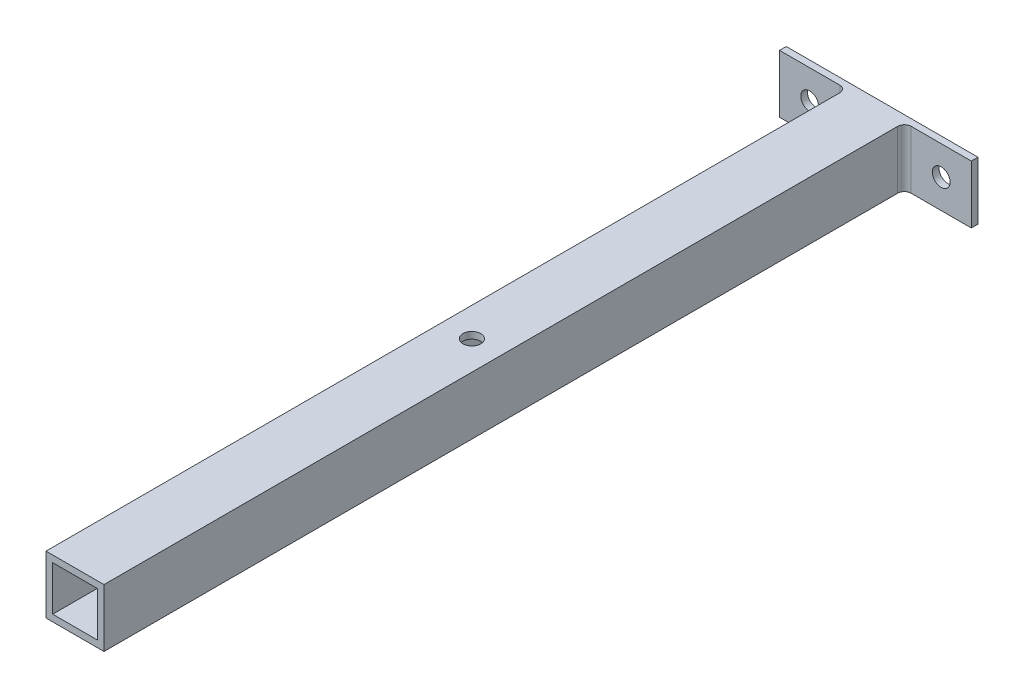
ISO-10303-21;
HEADER;
FILE_DESCRIPTION(('STEP AP214'),'2;1');
FILE_NAME('part.step','',(''),(''),'','','');
FILE_SCHEMA(('AUTOMOTIVE_DESIGN { 1 0 10303 214 1 1 1 1 }'));
ENDSEC;
DATA;
#1=APPLICATION_CONTEXT('core data for automotive mechanical design processes');
#2=APPLICATION_PROTOCOL_DEFINITION('international standard','automotive_design',2000,#1);
#3=PRODUCT_CONTEXT('',#1,'mechanical');
#4=PRODUCT('Part','Part','',(#3));
#5=PRODUCT_RELATED_PRODUCT_CATEGORY('part','',(#4));
#6=PRODUCT_DEFINITION_FORMATION('','',#4);
#7=PRODUCT_DEFINITION_CONTEXT('part definition',#1,'design');
#8=PRODUCT_DEFINITION('design','',#6,#7);
#9=PRODUCT_DEFINITION_SHAPE('','',#8);
#10=(LENGTH_UNIT() NAMED_UNIT(*) SI_UNIT(.MILLI.,.METRE.));
#11=(NAMED_UNIT(*) PLANE_ANGLE_UNIT() SI_UNIT($,.RADIAN.));
#12=(NAMED_UNIT(*) SI_UNIT($,.STERADIAN.) SOLID_ANGLE_UNIT());
#13=UNCERTAINTY_MEASURE_WITH_UNIT(LENGTH_MEASURE(1.E-05),#10,'distance_accuracy_value','');
#14=(GEOMETRIC_REPRESENTATION_CONTEXT(3) GLOBAL_UNCERTAINTY_ASSIGNED_CONTEXT((#13)) GLOBAL_UNIT_ASSIGNED_CONTEXT((#10,
#11,#12)) REPRESENTATION_CONTEXT('',''));
#15=CARTESIAN_POINT('',(0.,0.,0.));
#16=DIRECTION('',(0.,0.,1.));
#17=DIRECTION('',(1.,0.,0.));
#18=AXIS2_PLACEMENT_3D('',#15,#16,#17);
#19=CARTESIAN_POINT('',(-13.,26.,-181.));
#20=DIRECTION('',(0.,0.,1.));
#21=DIRECTION('',(1.,0.,0.));
#22=AXIS2_PLACEMENT_3D('',#19,#20,#21);
#23=PLANE('',#22);
#24=CARTESIAN_POINT('',(29.5,13.,-181.));
#25=DIRECTION('',(0.,0.,1.));
#26=DIRECTION('',(1.,0.,0.));
#27=AXIS2_PLACEMENT_3D('',#24,#25,#26);
#28=CIRCLE('',#27,4.);
#29=CARTESIAN_POINT('',(33.5,13.,-181.));
#30=VERTEX_POINT('',#29);
#31=EDGE_CURVE('E282',#30,#30,#28,.T.);
#32=ORIENTED_EDGE('',*,*,#31,.T.);
#33=EDGE_LOOP('',(#32));
#34=FACE_BOUND('',#33,.T.);
#35=CARTESIAN_POINT('',(-29.5,13.0000000000001,-181.));
#36=DIRECTION('',(0.,0.,1.));
#37=DIRECTION('',(-1.,0.,0.));
#38=AXIS2_PLACEMENT_3D('',#35,#36,#37);
#39=CIRCLE('',#38,3.99999999999999);
#40=CARTESIAN_POINT('',(-33.5,13.0000000000001,-181.));
#41=VERTEX_POINT('',#40);
#42=EDGE_CURVE('E286',#41,#41,#39,.T.);
#43=ORIENTED_EDGE('',*,*,#42,.T.);
#44=EDGE_LOOP('',(#43));
#45=FACE_BOUND('',#44,.T.);
#46=DIRECTION('',(-1.,0.,0.));
#47=VECTOR('',#46,1.);
#48=CARTESIAN_POINT('',(-13.,0.,-181.));
#49=LINE('',#48,#47);
#50=CARTESIAN_POINT('',(43.,0.,-181.));
#51=VERTEX_POINT('',#50);
#52=CARTESIAN_POINT('',(-43.,0.,-181.));
#53=VERTEX_POINT('',#52);
#54=EDGE_CURVE('E208',#51,#53,#49,.T.);
#55=ORIENTED_EDGE('',*,*,#54,.T.);
#56=DIRECTION('',(0.,-1.,0.));
#57=VECTOR('',#56,1.);
#58=CARTESIAN_POINT('',(-43.,26.,-181.));
#59=LINE('',#58,#57);
#60=CARTESIAN_POINT('',(-43.,26.,-181.));
#61=VERTEX_POINT('',#60);
#62=EDGE_CURVE('E226',#61,#53,#59,.T.);
#63=ORIENTED_EDGE('',*,*,#62,.F.);
#64=DIRECTION('',(-1.,0.,0.));
#65=VECTOR('',#64,1.);
#66=CARTESIAN_POINT('',(13.,26.,-181.));
#67=LINE('',#66,#65);
#68=CARTESIAN_POINT('',(43.,26.,-181.));
#69=VERTEX_POINT('',#68);
#70=EDGE_CURVE('E189',#69,#61,#67,.T.);
#71=ORIENTED_EDGE('',*,*,#70,.F.);
#72=DIRECTION('',(0.,-1.,0.));
#73=VECTOR('',#72,1.);
#74=CARTESIAN_POINT('',(43.,26.,-181.));
#75=LINE('',#74,#73);
#76=EDGE_CURVE('E229',#69,#51,#75,.T.);
#77=ORIENTED_EDGE('',*,*,#76,.T.);
#78=EDGE_LOOP('',(#55,#63,#71,#77));
#79=FACE_BOUND('',#78,.T.);
#80=DIRECTION('',(0.,-1.,0.));
#81=VECTOR('',#80,1.);
#82=CARTESIAN_POINT('',(-13.,3.,-181.));
#83=LINE('',#82,#81);
#84=CARTESIAN_POINT('',(-13.,23.,-181.));
#85=VERTEX_POINT('',#84);
#86=CARTESIAN_POINT('',(-13.,3.,-181.));
#87=VERTEX_POINT('',#86);
#88=EDGE_CURVE('E248',#85,#87,#83,.T.);
#89=ORIENTED_EDGE('',*,*,#88,.T.);
#90=DIRECTION('',(-1.,0.,0.));
#91=VECTOR('',#90,1.);
#92=CARTESIAN_POINT('',(-13.,3.,-181.));
#93=LINE('',#92,#91);
#94=CARTESIAN_POINT('',(13.,3.,-181.));
#95=VERTEX_POINT('',#94);
#96=EDGE_CURVE('E178',#95,#87,#93,.T.);
#97=ORIENTED_EDGE('',*,*,#96,.F.);
#98=DIRECTION('',(0.,-1.,0.));
#99=VECTOR('',#98,1.);
#100=CARTESIAN_POINT('',(13.,23.,-181.));
#101=LINE('',#100,#99);
#102=CARTESIAN_POINT('',(13.,23.,-181.));
#103=VERTEX_POINT('',#102);
#104=EDGE_CURVE('E245',#95,#103,#101,.F.);
#105=ORIENTED_EDGE('',*,*,#104,.T.);
#106=DIRECTION('',(-1.,0.,0.));
#107=VECTOR('',#106,1.);
#108=CARTESIAN_POINT('',(-13.,23.,-181.));
#109=LINE('',#108,#107);
#110=EDGE_CURVE('E164',#103,#85,#109,.T.);
#111=ORIENTED_EDGE('',*,*,#110,.T.);
#112=EDGE_LOOP('',(#89,#97,#105,#111));
#113=FACE_BOUND('',#112,.T.);
#114=ADVANCED_FACE('F35',(#34,#45,#79,#113),#23,.F.);
#115=CARTESIAN_POINT('',(-13.,26.,181.));
#116=DIRECTION('',(0.,0.,-1.));
#117=DIRECTION('',(-1.,0.,0.));
#118=AXIS2_PLACEMENT_3D('',#115,#116,#117);
#119=PLANE('',#118);
#120=DIRECTION('',(1.,0.,0.));
#121=VECTOR('',#120,1.);
#122=CARTESIAN_POINT('',(-13.,0.,181.));
#123=LINE('',#122,#121);
#124=CARTESIAN_POINT('',(-13.,0.,181.));
#125=VERTEX_POINT('',#124);
#126=CARTESIAN_POINT('',(13.,0.,181.));
#127=VERTEX_POINT('',#126);
#128=EDGE_CURVE('E185',#125,#127,#123,.T.);
#129=ORIENTED_EDGE('',*,*,#128,.T.);
#130=DIRECTION('',(0.,-1.,0.));
#131=VECTOR('',#130,1.);
#132=CARTESIAN_POINT('',(13.,26.,181.));
#133=LINE('',#132,#131);
#134=CARTESIAN_POINT('',(13.,26.,181.));
#135=VERTEX_POINT('',#134);
#136=EDGE_CURVE('E200',#135,#127,#133,.T.);
#137=ORIENTED_EDGE('',*,*,#136,.F.);
#138=DIRECTION('',(1.,0.,0.));
#139=VECTOR('',#138,1.);
#140=CARTESIAN_POINT('',(-13.,26.,181.));
#141=LINE('',#140,#139);
#142=CARTESIAN_POINT('',(-13.,26.,181.));
#143=VERTEX_POINT('',#142);
#144=EDGE_CURVE('E198',#143,#135,#141,.T.);
#145=ORIENTED_EDGE('',*,*,#144,.F.);
#146=DIRECTION('',(0.,-1.,0.));
#147=VECTOR('',#146,1.);
#148=CARTESIAN_POINT('',(-13.,26.,181.));
#149=LINE('',#148,#147);
#150=EDGE_CURVE('E220',#143,#125,#149,.T.);
#151=ORIENTED_EDGE('',*,*,#150,.T.);
#152=EDGE_LOOP('',(#129,#137,#145,#151));
#153=FACE_BOUND('',#152,.T.);
#154=DIRECTION('',(1.,0.,0.));
#155=VECTOR('',#154,1.);
#156=CARTESIAN_POINT('',(-13.,3.,181.));
#157=LINE('',#156,#155);
#158=CARTESIAN_POINT('',(-9.99999999999998,3.,181.));
#159=VERTEX_POINT('',#158);
#160=CARTESIAN_POINT('',(10.,3.,181.));
#161=VERTEX_POINT('',#160);
#162=EDGE_CURVE('E165',#159,#161,#157,.T.);
#163=ORIENTED_EDGE('',*,*,#162,.F.);
#164=DIRECTION('',(0.,-1.,0.));
#165=VECTOR('',#164,1.);
#166=CARTESIAN_POINT('',(-9.99999999999998,26.,181.));
#167=LINE('',#166,#165);
#168=CARTESIAN_POINT('',(-9.99999999999998,23.,181.));
#169=VERTEX_POINT('',#168);
#170=EDGE_CURVE('E157',#169,#159,#167,.T.);
#171=ORIENTED_EDGE('',*,*,#170,.F.);
#172=DIRECTION('',(1.,0.,0.));
#173=VECTOR('',#172,1.);
#174=CARTESIAN_POINT('',(-13.,23.,181.));
#175=LINE('',#174,#173);
#176=CARTESIAN_POINT('',(10.,23.,181.));
#177=VERTEX_POINT('',#176);
#178=EDGE_CURVE('E158',#169,#177,#175,.T.);
#179=ORIENTED_EDGE('',*,*,#178,.T.);
#180=DIRECTION('',(0.,-1.,0.));
#181=VECTOR('',#180,1.);
#182=CARTESIAN_POINT('',(10.,26.,181.));
#183=LINE('',#182,#181);
#184=EDGE_CURVE('E149',#177,#161,#183,.T.);
#185=ORIENTED_EDGE('',*,*,#184,.T.);
#186=EDGE_LOOP('',(#163,#171,#179,#185));
#187=FACE_BOUND('',#186,.T.);
#188=ADVANCED_FACE('F167',(#153,#187),#119,.F.);
#189=CARTESIAN_POINT('',(13.,26.,-178.));
#190=DIRECTION('',(-1.,0.,0.));
#191=DIRECTION('',(0.,0.,1.));
#192=AXIS2_PLACEMENT_3D('',#189,#190,#191);
#193=PLANE('',#192);
#194=DIRECTION('',(0.,0.,-1.));
#195=VECTOR('',#194,1.);
#196=CARTESIAN_POINT('',(13.,0.,-178.));
#197=LINE('',#196,#195);
#198=CARTESIAN_POINT('',(13.,0.,-175.));
#199=VERTEX_POINT('',#198);
#200=EDGE_CURVE('E175',#127,#199,#197,.T.);
#201=ORIENTED_EDGE('',*,*,#200,.T.);
#202=DIRECTION('',(0.,-1.,0.));
#203=VECTOR('',#202,1.);
#204=CARTESIAN_POINT('',(13.,26.,-175.));
#205=LINE('',#204,#203);
#206=CARTESIAN_POINT('',(13.,26.,-175.));
#207=VERTEX_POINT('',#206);
#208=EDGE_CURVE('E243',#199,#207,#205,.F.);
#209=ORIENTED_EDGE('',*,*,#208,.T.);
#210=DIRECTION('',(0.,0.,-1.));
#211=VECTOR('',#210,1.);
#212=CARTESIAN_POINT('',(13.,26.,-178.));
#213=LINE('',#212,#211);
#214=EDGE_CURVE('E181',#135,#207,#213,.T.);
#215=ORIENTED_EDGE('',*,*,#214,.F.);
#216=ORIENTED_EDGE('',*,*,#136,.T.);
#217=EDGE_LOOP('',(#201,#209,#215,#216));
#218=FACE_BOUND('',#217,.T.);
#219=ADVANCED_FACE('F330',(#218),#193,.F.);
#220=CARTESIAN_POINT('',(43.,26.,-178.));
#221=DIRECTION('',(0.,0.,-1.));
#222=DIRECTION('',(-1.,0.,0.));
#223=AXIS2_PLACEMENT_3D('',#220,#221,#222);
#224=PLANE('',#223);
#225=CARTESIAN_POINT('',(29.5,13.,-178.));
#226=DIRECTION('',(0.,0.,1.));
#227=DIRECTION('',(1.,0.,0.));
#228=AXIS2_PLACEMENT_3D('',#225,#226,#227);
#229=CIRCLE('',#228,4.);
#230=CARTESIAN_POINT('',(33.5,13.,-178.));
#231=VERTEX_POINT('',#230);
#232=EDGE_CURVE('E290',#231,#231,#229,.T.);
#233=ORIENTED_EDGE('',*,*,#232,.F.);
#234=EDGE_LOOP('',(#233));
#235=FACE_BOUND('',#234,.T.);
#236=DIRECTION('',(1.,0.,0.));
#237=VECTOR('',#236,1.);
#238=CARTESIAN_POINT('',(43.,26.,-178.));
#239=LINE('',#238,#237);
#240=CARTESIAN_POINT('',(16.,26.,-178.));
#241=VERTEX_POINT('',#240);
#242=CARTESIAN_POINT('',(43.,26.,-178.));
#243=VERTEX_POINT('',#242);
#244=EDGE_CURVE('E184',#241,#243,#239,.T.);
#245=ORIENTED_EDGE('',*,*,#244,.F.);
#246=DIRECTION('',(0.,-1.,0.));
#247=VECTOR('',#246,1.);
#248=CARTESIAN_POINT('',(16.,0.,-178.));
#249=LINE('',#248,#247);
#250=CARTESIAN_POINT('',(16.,0.,-178.));
#251=VERTEX_POINT('',#250);
#252=EDGE_CURVE('E240',#241,#251,#249,.T.);
#253=ORIENTED_EDGE('',*,*,#252,.T.);
#254=DIRECTION('',(1.,0.,0.));
#255=VECTOR('',#254,1.);
#256=CARTESIAN_POINT('',(43.,0.,-178.));
#257=LINE('',#256,#255);
#258=CARTESIAN_POINT('',(43.,0.,-178.));
#259=VERTEX_POINT('',#258);
#260=EDGE_CURVE('E203',#251,#259,#257,.T.);
#261=ORIENTED_EDGE('',*,*,#260,.T.);
#262=DIRECTION('',(0.,-1.,0.));
#263=VECTOR('',#262,1.);
#264=CARTESIAN_POINT('',(43.,26.,-178.));
#265=LINE('',#264,#263);
#266=EDGE_CURVE('E232',#243,#259,#265,.T.);
#267=ORIENTED_EDGE('',*,*,#266,.F.);
#268=EDGE_LOOP('',(#245,#253,#261,#267));
#269=FACE_BOUND('',#268,.T.);
#270=ADVANCED_FACE('F341',(#235,#269),#224,.F.);
#271=CARTESIAN_POINT('',(43.,26.,-181.));
#272=DIRECTION('',(-1.,0.,0.));
#273=DIRECTION('',(0.,0.,1.));
#274=AXIS2_PLACEMENT_3D('',#271,#272,#273);
#275=PLANE('',#274);
#276=DIRECTION('',(0.,0.,-1.));
#277=VECTOR('',#276,1.);
#278=CARTESIAN_POINT('',(43.,0.,-181.));
#279=LINE('',#278,#277);
#280=EDGE_CURVE('E205',#259,#51,#279,.T.);
#281=ORIENTED_EDGE('',*,*,#280,.T.);
#282=ORIENTED_EDGE('',*,*,#76,.F.);
#283=DIRECTION('',(0.,0.,-1.));
#284=VECTOR('',#283,1.);
#285=CARTESIAN_POINT('',(43.,26.,-181.));
#286=LINE('',#285,#284);
#287=EDGE_CURVE('E187',#243,#69,#286,.T.);
#288=ORIENTED_EDGE('',*,*,#287,.F.);
#289=ORIENTED_EDGE('',*,*,#266,.T.);
#290=EDGE_LOOP('',(#281,#282,#288,#289));
#291=FACE_BOUND('',#290,.T.);
#292=ADVANCED_FACE('F338',(#291),#275,.F.);
#293=CARTESIAN_POINT('',(-43.,26.,-181.));
#294=DIRECTION('',(1.,0.,0.));
#295=DIRECTION('',(0.,0.,-1.));
#296=AXIS2_PLACEMENT_3D('',#293,#294,#295);
#297=PLANE('',#296);
#298=DIRECTION('',(0.,0.,1.));
#299=VECTOR('',#298,1.);
#300=CARTESIAN_POINT('',(-43.,0.,-181.));
#301=LINE('',#300,#299);
#302=CARTESIAN_POINT('',(-43.,0.,-178.));
#303=VERTEX_POINT('',#302);
#304=EDGE_CURVE('E210',#53,#303,#301,.T.);
#305=ORIENTED_EDGE('',*,*,#304,.T.);
#306=DIRECTION('',(0.,-1.,0.));
#307=VECTOR('',#306,1.);
#308=CARTESIAN_POINT('',(-43.,26.,-178.));
#309=LINE('',#308,#307);
#310=CARTESIAN_POINT('',(-43.,26.,-178.));
#311=VERTEX_POINT('',#310);
#312=EDGE_CURVE('E223',#311,#303,#309,.T.);
#313=ORIENTED_EDGE('',*,*,#312,.F.);
#314=DIRECTION('',(0.,0.,1.));
#315=VECTOR('',#314,1.);
#316=CARTESIAN_POINT('',(-43.,26.,-181.));
#317=LINE('',#316,#315);
#318=EDGE_CURVE('E191',#61,#311,#317,.T.);
#319=ORIENTED_EDGE('',*,*,#318,.F.);
#320=ORIENTED_EDGE('',*,*,#62,.T.);
#321=EDGE_LOOP('',(#305,#313,#319,#320));
#322=FACE_BOUND('',#321,.T.);
#323=ADVANCED_FACE('F336',(#322),#297,.F.);
#324=CARTESIAN_POINT('',(-43.,26.,-178.));
#325=DIRECTION('',(0.,0.,-1.));
#326=DIRECTION('',(-1.,0.,0.));
#327=AXIS2_PLACEMENT_3D('',#324,#325,#326);
#328=PLANE('',#327);
#329=CARTESIAN_POINT('',(-29.5,13.0000000000001,-178.));
#330=DIRECTION('',(0.,0.,1.));
#331=DIRECTION('',(-1.,0.,0.));
#332=AXIS2_PLACEMENT_3D('',#329,#330,#331);
#333=CIRCLE('',#332,3.99999999999999);
#334=CARTESIAN_POINT('',(-33.5,13.0000000000001,-178.));
#335=VERTEX_POINT('',#334);
#336=EDGE_CURVE('E283',#335,#335,#333,.T.);
#337=ORIENTED_EDGE('',*,*,#336,.F.);
#338=EDGE_LOOP('',(#337));
#339=FACE_BOUND('',#338,.T.);
#340=DIRECTION('',(1.,0.,0.));
#341=VECTOR('',#340,1.);
#342=CARTESIAN_POINT('',(-43.,0.,-178.));
#343=LINE('',#342,#341);
#344=CARTESIAN_POINT('',(-16.,0.,-178.));
#345=VERTEX_POINT('',#344);
#346=EDGE_CURVE('E212',#303,#345,#343,.T.);
#347=ORIENTED_EDGE('',*,*,#346,.T.);
#348=DIRECTION('',(0.,-1.,0.));
#349=VECTOR('',#348,1.);
#350=CARTESIAN_POINT('',(-16.,26.,-178.));
#351=LINE('',#350,#349);
#352=CARTESIAN_POINT('',(-16.,26.,-178.));
#353=VERTEX_POINT('',#352);
#354=EDGE_CURVE('E238',#345,#353,#351,.F.);
#355=ORIENTED_EDGE('',*,*,#354,.T.);
#356=DIRECTION('',(1.,0.,0.));
#357=VECTOR('',#356,1.);
#358=CARTESIAN_POINT('',(-43.,26.,-178.));
#359=LINE('',#358,#357);
#360=EDGE_CURVE('E193',#311,#353,#359,.T.);
#361=ORIENTED_EDGE('',*,*,#360,.F.);
#362=ORIENTED_EDGE('',*,*,#312,.T.);
#363=EDGE_LOOP('',(#347,#355,#361,#362));
#364=FACE_BOUND('',#363,.T.);
#365=ADVANCED_FACE('F427',(#339,#364),#328,.F.);
#366=CARTESIAN_POINT('',(-13.,26.,-178.));
#367=DIRECTION('',(1.,0.,0.));
#368=DIRECTION('',(0.,0.,-1.));
#369=AXIS2_PLACEMENT_3D('',#366,#367,#368);
#370=PLANE('',#369);
#371=DIRECTION('',(0.,0.,1.));
#372=VECTOR('',#371,1.);
#373=CARTESIAN_POINT('',(-13.,26.,-178.));
#374=LINE('',#373,#372);
#375=CARTESIAN_POINT('',(-13.,26.,-175.));
#376=VERTEX_POINT('',#375);
#377=EDGE_CURVE('E196',#376,#143,#374,.T.);
#378=ORIENTED_EDGE('',*,*,#377,.F.);
#379=DIRECTION('',(0.,-1.,0.));
#380=VECTOR('',#379,1.);
#381=CARTESIAN_POINT('',(-13.,0.,-175.));
#382=LINE('',#381,#380);
#383=CARTESIAN_POINT('',(-13.,0.,-175.));
#384=VERTEX_POINT('',#383);
#385=EDGE_CURVE('E235',#376,#384,#382,.T.);
#386=ORIENTED_EDGE('',*,*,#385,.T.);
#387=DIRECTION('',(0.,0.,1.));
#388=VECTOR('',#387,1.);
#389=CARTESIAN_POINT('',(-13.,0.,-178.));
#390=LINE('',#389,#388);
#391=EDGE_CURVE('E215',#384,#125,#390,.T.);
#392=ORIENTED_EDGE('',*,*,#391,.T.);
#393=ORIENTED_EDGE('',*,*,#150,.F.);
#394=EDGE_LOOP('',(#378,#386,#392,#393));
#395=FACE_BOUND('',#394,.T.);
#396=ADVANCED_FACE('F431',(#395),#370,.F.);
#397=CARTESIAN_POINT('',(0.,26.,0.));
#398=DIRECTION('',(0.,1.,0.));
#399=DIRECTION('',(0.,0.,1.));
#400=AXIS2_PLACEMENT_3D('',#397,#398,#399);
#401=PLANE('',#400);
#402=CARTESIAN_POINT('',(0.,26.,3.));
#403=DIRECTION('',(0.,1.,0.));
#404=DIRECTION('',(0.,0.,1.));
#405=AXIS2_PLACEMENT_3D('',#402,#403,#404);
#406=CIRCLE('',#405,4.);
#407=CARTESIAN_POINT('',(0.,26.,7.));
#408=VERTEX_POINT('',#407);
#409=EDGE_CURVE('E300',#408,#408,#406,.T.);
#410=ORIENTED_EDGE('',*,*,#409,.F.);
#411=EDGE_LOOP('',(#410));
#412=FACE_BOUND('',#411,.T.);
#413=ORIENTED_EDGE('',*,*,#214,.T.);
#414=CARTESIAN_POINT('',(16.,26.,-175.));
#415=DIRECTION('',(0.,1.,0.));
#416=DIRECTION('',(0.,0.,1.));
#417=AXIS2_PLACEMENT_3D('',#414,#415,#416);
#418=CIRCLE('',#417,3.);
#419=EDGE_CURVE('E261',#207,#241,#418,.F.);
#420=ORIENTED_EDGE('',*,*,#419,.T.);
#421=ORIENTED_EDGE('',*,*,#244,.T.);
#422=ORIENTED_EDGE('',*,*,#287,.T.);
#423=ORIENTED_EDGE('',*,*,#70,.T.);
#424=ORIENTED_EDGE('',*,*,#318,.T.);
#425=ORIENTED_EDGE('',*,*,#360,.T.);
#426=CARTESIAN_POINT('',(-16.,26.,-175.));
#427=DIRECTION('',(0.,1.,0.));
#428=DIRECTION('',(0.,0.,1.));
#429=AXIS2_PLACEMENT_3D('',#426,#427,#428);
#430=CIRCLE('',#429,3.);
#431=EDGE_CURVE('E257',#353,#376,#430,.F.);
#432=ORIENTED_EDGE('',*,*,#431,.T.);
#433=ORIENTED_EDGE('',*,*,#377,.T.);
#434=ORIENTED_EDGE('',*,*,#144,.T.);
#435=EDGE_LOOP('',(#413,#420,#421,#422,#423,#424,#425,#432,#433,#434));
#436=FACE_BOUND('',#435,.T.);
#437=ADVANCED_FACE('F452',(#412,#436),#401,.T.);
#438=CARTESIAN_POINT('',(0.,0.,0.));
#439=DIRECTION('',(0.,1.,0.));
#440=DIRECTION('',(0.,0.,1.));
#441=AXIS2_PLACEMENT_3D('',#438,#439,#440);
#442=PLANE('',#441);
#443=CARTESIAN_POINT('',(0.,0.,3.));
#444=DIRECTION('',(0.,1.,0.));
#445=DIRECTION('',(0.,0.,1.));
#446=AXIS2_PLACEMENT_3D('',#443,#444,#445);
#447=CIRCLE('',#446,4.);
#448=CARTESIAN_POINT('',(0.,0.,7.));
#449=VERTEX_POINT('',#448);
#450=EDGE_CURVE('E287',#449,#449,#447,.T.);
#451=ORIENTED_EDGE('',*,*,#450,.T.);
#452=EDGE_LOOP('',(#451));
#453=FACE_BOUND('',#452,.T.);
#454=ORIENTED_EDGE('',*,*,#200,.F.);
#455=ORIENTED_EDGE('',*,*,#128,.F.);
#456=ORIENTED_EDGE('',*,*,#391,.F.);
#457=CARTESIAN_POINT('',(-16.,0.,-175.));
#458=DIRECTION('',(0.,1.,0.));
#459=DIRECTION('',(0.,0.,1.));
#460=AXIS2_PLACEMENT_3D('',#457,#458,#459);
#461=CIRCLE('',#460,3.);
#462=EDGE_CURVE('E255',#384,#345,#461,.T.);
#463=ORIENTED_EDGE('',*,*,#462,.T.);
#464=ORIENTED_EDGE('',*,*,#346,.F.);
#465=ORIENTED_EDGE('',*,*,#304,.F.);
#466=ORIENTED_EDGE('',*,*,#54,.F.);
#467=ORIENTED_EDGE('',*,*,#280,.F.);
#468=ORIENTED_EDGE('',*,*,#260,.F.);
#469=CARTESIAN_POINT('',(16.,0.,-175.));
#470=DIRECTION('',(0.,1.,0.));
#471=DIRECTION('',(0.,0.,1.));
#472=AXIS2_PLACEMENT_3D('',#469,#470,#471);
#473=CIRCLE('',#472,3.);
#474=EDGE_CURVE('E259',#251,#199,#473,.T.);
#475=ORIENTED_EDGE('',*,*,#474,.T.);
#476=EDGE_LOOP('',(#454,#455,#456,#463,#464,#465,#466,#467,#468,#475));
#477=FACE_BOUND('',#476,.T.);
#478=ADVANCED_FACE('F373',(#453,#477),#442,.F.);
#479=CARTESIAN_POINT('',(9.99999999999998,26.,-178.));
#480=DIRECTION('',(-1.,0.,0.));
#481=DIRECTION('',(0.,0.,1.));
#482=AXIS2_PLACEMENT_3D('',#479,#480,#481);
#483=PLANE('',#482);
#484=DIRECTION('',(0.,0.,-1.));
#485=VECTOR('',#484,1.);
#486=CARTESIAN_POINT('',(9.99999999999998,23.,-178.));
#487=LINE('',#486,#485);
#488=CARTESIAN_POINT('',(9.99999999999998,23.,-178.));
#489=VERTEX_POINT('',#488);
#490=EDGE_CURVE('E151',#177,#489,#487,.T.);
#491=ORIENTED_EDGE('',*,*,#490,.T.);
#492=DIRECTION('',(0.,-1.,0.));
#493=VECTOR('',#492,1.);
#494=CARTESIAN_POINT('',(9.99999999999998,3.,-178.));
#495=LINE('',#494,#493);
#496=CARTESIAN_POINT('',(9.99999999999998,3.,-178.));
#497=VERTEX_POINT('',#496);
#498=EDGE_CURVE('E253',#489,#497,#495,.T.);
#499=ORIENTED_EDGE('',*,*,#498,.T.);
#500=DIRECTION('',(0.,0.,-1.));
#501=VECTOR('',#500,1.);
#502=CARTESIAN_POINT('',(9.99999999999998,3.,-178.));
#503=LINE('',#502,#501);
#504=EDGE_CURVE('E153',#161,#497,#503,.T.);
#505=ORIENTED_EDGE('',*,*,#504,.F.);
#506=ORIENTED_EDGE('',*,*,#184,.F.);
#507=EDGE_LOOP('',(#491,#499,#505,#506));
#508=FACE_BOUND('',#507,.T.);
#509=ADVANCED_FACE('F150',(#508),#483,.T.);
#510=CARTESIAN_POINT('',(-10.,26.,-178.));
#511=DIRECTION('',(1.,0.,0.));
#512=DIRECTION('',(0.,0.,-1.));
#513=AXIS2_PLACEMENT_3D('',#510,#511,#512);
#514=PLANE('',#513);
#515=DIRECTION('',(0.,0.,1.));
#516=VECTOR('',#515,1.);
#517=CARTESIAN_POINT('',(-10.,3.,-178.));
#518=LINE('',#517,#516);
#519=CARTESIAN_POINT('',(-10.,3.,-178.));
#520=VERTEX_POINT('',#519);
#521=EDGE_CURVE('E177',#520,#159,#518,.T.);
#522=ORIENTED_EDGE('',*,*,#521,.F.);
#523=DIRECTION('',(0.,-1.,0.));
#524=VECTOR('',#523,1.);
#525=CARTESIAN_POINT('',(-10.,23.,-178.));
#526=LINE('',#525,#524);
#527=CARTESIAN_POINT('',(-10.,23.,-178.));
#528=VERTEX_POINT('',#527);
#529=EDGE_CURVE('E251',#520,#528,#526,.F.);
#530=ORIENTED_EDGE('',*,*,#529,.T.);
#531=DIRECTION('',(0.,0.,1.));
#532=VECTOR('',#531,1.);
#533=CARTESIAN_POINT('',(-10.,23.,-178.));
#534=LINE('',#533,#532);
#535=EDGE_CURVE('E169',#528,#169,#534,.T.);
#536=ORIENTED_EDGE('',*,*,#535,.T.);
#537=ORIENTED_EDGE('',*,*,#170,.T.);
#538=EDGE_LOOP('',(#522,#530,#536,#537));
#539=FACE_BOUND('',#538,.T.);
#540=ADVANCED_FACE('F279',(#539),#514,.T.);
#541=CARTESIAN_POINT('',(0.,23.,0.));
#542=DIRECTION('',(0.,1.,0.));
#543=DIRECTION('',(0.,0.,1.));
#544=AXIS2_PLACEMENT_3D('',#541,#542,#543);
#545=PLANE('',#544);
#546=CARTESIAN_POINT('',(0.,23.,3.));
#547=DIRECTION('',(0.,1.,0.));
#548=DIRECTION('',(0.,0.,1.));
#549=AXIS2_PLACEMENT_3D('',#546,#547,#548);
#550=CIRCLE('',#549,4.);
#551=CARTESIAN_POINT('',(0.,23.,7.));
#552=VERTEX_POINT('',#551);
#553=EDGE_CURVE('E297',#552,#552,#550,.T.);
#554=ORIENTED_EDGE('',*,*,#553,.T.);
#555=EDGE_LOOP('',(#554));
#556=FACE_BOUND('',#555,.T.);
#557=ORIENTED_EDGE('',*,*,#490,.F.);
#558=ORIENTED_EDGE('',*,*,#178,.F.);
#559=ORIENTED_EDGE('',*,*,#535,.F.);
#560=CARTESIAN_POINT('',(-13.,23.,-178.));
#561=DIRECTION('',(0.,1.,0.));
#562=DIRECTION('',(0.,0.,1.));
#563=AXIS2_PLACEMENT_3D('',#560,#561,#562);
#564=CIRCLE('',#563,3.);
#565=EDGE_CURVE('E265',#528,#85,#564,.T.);
#566=ORIENTED_EDGE('',*,*,#565,.T.);
#567=ORIENTED_EDGE('',*,*,#110,.F.);
#568=CARTESIAN_POINT('',(13.,23.,-178.));
#569=DIRECTION('',(0.,1.,0.));
#570=DIRECTION('',(0.,0.,1.));
#571=AXIS2_PLACEMENT_3D('',#568,#569,#570);
#572=CIRCLE('',#571,3.);
#573=EDGE_CURVE('E11',#103,#489,#572,.T.);
#574=ORIENTED_EDGE('',*,*,#573,.T.);
#575=EDGE_LOOP('',(#557,#558,#559,#566,#567,#574));
#576=FACE_BOUND('',#575,.T.);
#577=ADVANCED_FACE('F161',(#556,#576),#545,.F.);
#578=CARTESIAN_POINT('',(0.,3.,0.));
#579=DIRECTION('',(0.,1.,0.));
#580=DIRECTION('',(0.,0.,1.));
#581=AXIS2_PLACEMENT_3D('',#578,#579,#580);
#582=PLANE('',#581);
#583=CARTESIAN_POINT('',(0.,3.,3.));
#584=DIRECTION('',(0.,1.,0.));
#585=DIRECTION('',(0.,0.,1.));
#586=AXIS2_PLACEMENT_3D('',#583,#584,#585);
#587=CIRCLE('',#586,4.);
#588=CARTESIAN_POINT('',(0.,3.,7.));
#589=VERTEX_POINT('',#588);
#590=EDGE_CURVE('E39',#589,#589,#587,.T.);
#591=ORIENTED_EDGE('',*,*,#590,.F.);
#592=EDGE_LOOP('',(#591));
#593=FACE_BOUND('',#592,.T.);
#594=ORIENTED_EDGE('',*,*,#504,.T.);
#595=CARTESIAN_POINT('',(13.,3.,-178.));
#596=DIRECTION('',(0.,1.,0.));
#597=DIRECTION('',(0.,0.,1.));
#598=AXIS2_PLACEMENT_3D('',#595,#596,#597);
#599=CIRCLE('',#598,3.);
#600=EDGE_CURVE('E44',#497,#95,#599,.F.);
#601=ORIENTED_EDGE('',*,*,#600,.T.);
#602=ORIENTED_EDGE('',*,*,#96,.T.);
#603=CARTESIAN_POINT('',(-13.,3.,-178.));
#604=DIRECTION('',(0.,1.,0.));
#605=DIRECTION('',(0.,0.,1.));
#606=AXIS2_PLACEMENT_3D('',#603,#604,#605);
#607=CIRCLE('',#606,3.);
#608=EDGE_CURVE('E263',#87,#520,#607,.F.);
#609=ORIENTED_EDGE('',*,*,#608,.T.);
#610=ORIENTED_EDGE('',*,*,#521,.T.);
#611=ORIENTED_EDGE('',*,*,#162,.T.);
#612=EDGE_LOOP('',(#594,#601,#602,#609,#610,#611));
#613=FACE_BOUND('',#612,.T.);
#614=ADVANCED_FACE('F269',(#593,#613),#582,.T.);
#615=CARTESIAN_POINT('',(-16.,26.,-175.));
#616=DIRECTION('',(0.,1.,0.));
#617=DIRECTION('',(0.,0.,1.));
#618=AXIS2_PLACEMENT_3D('',#615,#616,#617);
#619=CYLINDRICAL_SURFACE('',#618,3.);
#620=ORIENTED_EDGE('',*,*,#431,.F.);
#621=ORIENTED_EDGE('',*,*,#354,.F.);
#622=ORIENTED_EDGE('',*,*,#462,.F.);
#623=ORIENTED_EDGE('',*,*,#385,.F.);
#624=EDGE_LOOP('',(#620,#621,#622,#623));
#625=FACE_BOUND('',#624,.T.);
#626=ADVANCED_FACE('F311',(#625),#619,.F.);
#627=CARTESIAN_POINT('',(16.,26.,-175.));
#628=DIRECTION('',(0.,1.,0.));
#629=DIRECTION('',(0.,0.,1.));
#630=AXIS2_PLACEMENT_3D('',#627,#628,#629);
#631=CYLINDRICAL_SURFACE('',#630,3.);
#632=ORIENTED_EDGE('',*,*,#419,.F.);
#633=ORIENTED_EDGE('',*,*,#208,.F.);
#634=ORIENTED_EDGE('',*,*,#474,.F.);
#635=ORIENTED_EDGE('',*,*,#252,.F.);
#636=EDGE_LOOP('',(#632,#633,#634,#635));
#637=FACE_BOUND('',#636,.T.);
#638=ADVANCED_FACE('F318',(#637),#631,.F.);
#639=CARTESIAN_POINT('',(-13.,26.,-178.));
#640=DIRECTION('',(0.,1.,0.));
#641=DIRECTION('',(0.,0.,1.));
#642=AXIS2_PLACEMENT_3D('',#639,#640,#641);
#643=CYLINDRICAL_SURFACE('',#642,3.);
#644=ORIENTED_EDGE('',*,*,#565,.F.);
#645=ORIENTED_EDGE('',*,*,#529,.F.);
#646=ORIENTED_EDGE('',*,*,#608,.F.);
#647=ORIENTED_EDGE('',*,*,#88,.F.);
#648=EDGE_LOOP('',(#644,#645,#646,#647));
#649=FACE_BOUND('',#648,.T.);
#650=ADVANCED_FACE('F275',(#649),#643,.T.);
#651=CARTESIAN_POINT('',(13.,26.,-178.));
#652=DIRECTION('',(0.,1.,0.));
#653=DIRECTION('',(0.,0.,1.));
#654=AXIS2_PLACEMENT_3D('',#651,#652,#653);
#655=CYLINDRICAL_SURFACE('',#654,3.);
#656=ORIENTED_EDGE('',*,*,#573,.F.);
#657=ORIENTED_EDGE('',*,*,#104,.F.);
#658=ORIENTED_EDGE('',*,*,#600,.F.);
#659=ORIENTED_EDGE('',*,*,#498,.F.);
#660=EDGE_LOOP('',(#656,#657,#658,#659));
#661=FACE_BOUND('',#660,.T.);
#662=ADVANCED_FACE('F37',(#661),#655,.T.);
#663=CARTESIAN_POINT('',(-29.5,13.0000000000001,-181.));
#664=DIRECTION('',(0.,0.,1.));
#665=DIRECTION('',(1.,0.,0.));
#666=AXIS2_PLACEMENT_3D('',#663,#664,#665);
#667=CYLINDRICAL_SURFACE('',#666,3.99999999999999);
#668=ORIENTED_EDGE('',*,*,#42,.F.);
#669=EDGE_LOOP('',(#668));
#670=FACE_BOUND('',#669,.T.);
#671=ORIENTED_EDGE('',*,*,#336,.T.);
#672=EDGE_LOOP('',(#671));
#673=FACE_BOUND('',#672,.T.);
#674=ADVANCED_FACE('F355',(#670,#673),#667,.F.);
#675=CARTESIAN_POINT('',(29.5,13.,-181.));
#676=DIRECTION('',(0.,0.,1.));
#677=DIRECTION('',(1.,0.,0.));
#678=AXIS2_PLACEMENT_3D('',#675,#676,#677);
#679=CYLINDRICAL_SURFACE('',#678,4.);
#680=ORIENTED_EDGE('',*,*,#31,.F.);
#681=EDGE_LOOP('',(#680));
#682=FACE_BOUND('',#681,.T.);
#683=ORIENTED_EDGE('',*,*,#232,.T.);
#684=EDGE_LOOP('',(#683));
#685=FACE_BOUND('',#684,.T.);
#686=ADVANCED_FACE('F359',(#682,#685),#679,.F.);
#687=CARTESIAN_POINT('',(0.,-11.,3.));
#688=DIRECTION('',(0.,1.,0.));
#689=DIRECTION('',(0.,0.,1.));
#690=AXIS2_PLACEMENT_3D('',#687,#688,#689);
#691=CYLINDRICAL_SURFACE('',#690,4.);
#692=ORIENTED_EDGE('',*,*,#590,.T.);
#693=EDGE_LOOP('',(#692));
#694=FACE_BOUND('',#693,.T.);
#695=ORIENTED_EDGE('',*,*,#450,.F.);
#696=EDGE_LOOP('',(#695));
#697=FACE_BOUND('',#696,.T.);
#698=ADVANCED_FACE('F307',(#694,#697),#691,.F.);
#699=ORIENTED_EDGE('',*,*,#409,.T.);
#700=EDGE_LOOP('',(#699));
#701=FACE_BOUND('',#700,.T.);
#702=ORIENTED_EDGE('',*,*,#553,.F.);
#703=EDGE_LOOP('',(#702));
#704=FACE_BOUND('',#703,.T.);
#705=ADVANCED_FACE('F539',(#701,#704),#691,.F.);
#706=CLOSED_SHELL('',(#114,#188,#219,#270,#292,#323,#365,#396,#437,#478,#509,#540,#577,#614,
#626,#638,#650,#662,#674,#686,#698,#705));
#707=MANIFOLD_SOLID_BREP('B2',#706);
#708=ADVANCED_BREP_SHAPE_REPRESENTATION('',(#18,#707),#14);
#709=SHAPE_DEFINITION_REPRESENTATION(#9,#708);
ENDSEC;
END-ISO-10303-21;
